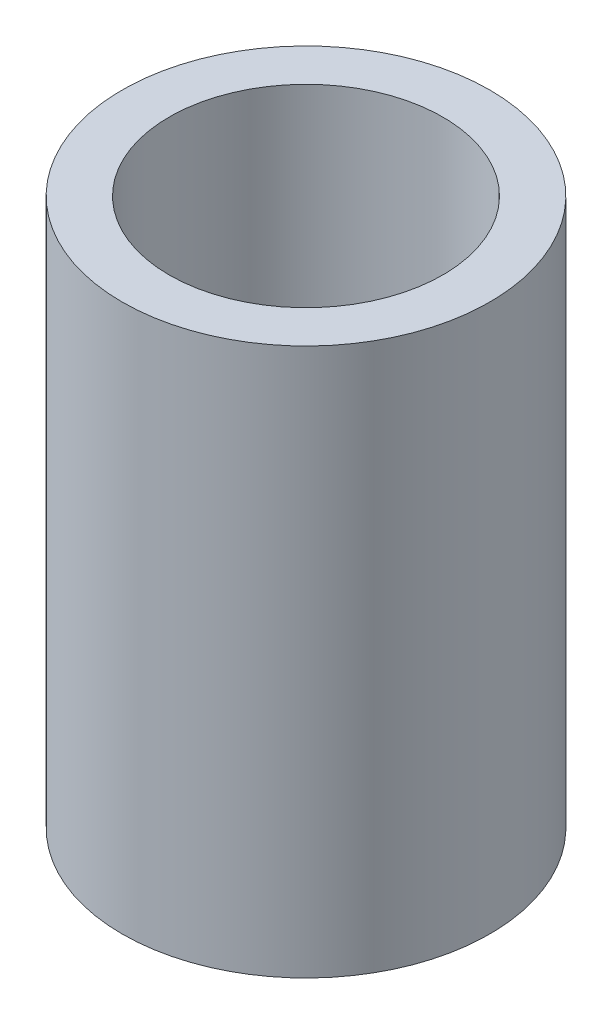
ISO-10303-21;
HEADER;
FILE_DESCRIPTION(('STEP AP214'),'2;1');
FILE_NAME('part.step','',(''),(''),'','','');
FILE_SCHEMA(('AUTOMOTIVE_DESIGN { 1 0 10303 214 1 1 1 1 }'));
ENDSEC;
DATA;
#1=APPLICATION_CONTEXT('core data for automotive mechanical design processes');
#2=APPLICATION_PROTOCOL_DEFINITION('international standard','automotive_design',2000,#1);
#3=PRODUCT_CONTEXT('',#1,'mechanical');
#4=PRODUCT('Part','Part','',(#3));
#5=PRODUCT_RELATED_PRODUCT_CATEGORY('part','',(#4));
#6=PRODUCT_DEFINITION_FORMATION('','',#4);
#7=PRODUCT_DEFINITION_CONTEXT('part definition',#1,'design');
#8=PRODUCT_DEFINITION('design','',#6,#7);
#9=PRODUCT_DEFINITION_SHAPE('','',#8);
#10=(LENGTH_UNIT() NAMED_UNIT(*) SI_UNIT(.MILLI.,.METRE.));
#11=(NAMED_UNIT(*) PLANE_ANGLE_UNIT() SI_UNIT($,.RADIAN.));
#12=(NAMED_UNIT(*) SI_UNIT($,.STERADIAN.) SOLID_ANGLE_UNIT());
#13=UNCERTAINTY_MEASURE_WITH_UNIT(LENGTH_MEASURE(1.E-05),#10,'distance_accuracy_value','');
#14=(GEOMETRIC_REPRESENTATION_CONTEXT(3) GLOBAL_UNCERTAINTY_ASSIGNED_CONTEXT((#13)) GLOBAL_UNIT_ASSIGNED_CONTEXT((#10,
#11,#12)) REPRESENTATION_CONTEXT('',''));
#15=CARTESIAN_POINT('',(0.,0.,0.));
#16=DIRECTION('',(0.,0.,1.));
#17=DIRECTION('',(1.,0.,0.));
#18=AXIS2_PLACEMENT_3D('',#15,#16,#17);
#19=CARTESIAN_POINT('',(0.,14.,0.));
#20=DIRECTION('',(0.,1.,0.));
#21=DIRECTION('',(0.,0.,1.));
#22=AXIS2_PLACEMENT_3D('',#19,#20,#21);
#23=PLANE('',#22);
#24=CARTESIAN_POINT('',(0.,14.,0.));
#25=DIRECTION('',(0.,1.,0.));
#26=DIRECTION('',(0.,0.,1.));
#27=AXIS2_PLACEMENT_3D('',#24,#25,#26);
#28=CIRCLE('',#27,4.7);
#29=CARTESIAN_POINT('',(0.,14.,4.7));
#30=VERTEX_POINT('',#29);
#31=EDGE_CURVE('E10',#30,#30,#28,.T.);
#32=ORIENTED_EDGE('',*,*,#31,.T.);
#33=EDGE_LOOP('',(#32));
#34=FACE_BOUND('',#33,.T.);
#35=CARTESIAN_POINT('',(0.,14.,0.));
#36=DIRECTION('',(0.,1.,0.));
#37=DIRECTION('',(0.,0.,1.));
#38=AXIS2_PLACEMENT_3D('',#35,#36,#37);
#39=CIRCLE('',#38,3.5);
#40=CARTESIAN_POINT('',(0.,14.,3.5));
#41=VERTEX_POINT('',#40);
#42=EDGE_CURVE('E42',#41,#41,#39,.T.);
#43=ORIENTED_EDGE('',*,*,#42,.F.);
#44=EDGE_LOOP('',(#43));
#45=FACE_BOUND('',#44,.T.);
#46=ADVANCED_FACE('F31',(#34,#45),#23,.T.);
#47=CARTESIAN_POINT('',(0.,0.,0.));
#48=DIRECTION('',(0.,1.,0.));
#49=DIRECTION('',(0.,0.,1.));
#50=AXIS2_PLACEMENT_3D('',#47,#48,#49);
#51=PLANE('',#50);
#52=CARTESIAN_POINT('',(0.,0.,0.));
#53=DIRECTION('',(0.,1.,0.));
#54=DIRECTION('',(0.,0.,1.));
#55=AXIS2_PLACEMENT_3D('',#52,#53,#54);
#56=CIRCLE('',#55,4.7);
#57=CARTESIAN_POINT('',(0.,0.,4.7));
#58=VERTEX_POINT('',#57);
#59=EDGE_CURVE('E35',#58,#58,#56,.T.);
#60=ORIENTED_EDGE('',*,*,#59,.F.);
#61=EDGE_LOOP('',(#60));
#62=FACE_BOUND('',#61,.T.);
#63=CARTESIAN_POINT('',(0.,0.,0.));
#64=DIRECTION('',(0.,1.,0.));
#65=DIRECTION('',(0.,0.,1.));
#66=AXIS2_PLACEMENT_3D('',#63,#64,#65);
#67=CIRCLE('',#66,3.5);
#68=CARTESIAN_POINT('',(0.,0.,3.5));
#69=VERTEX_POINT('',#68);
#70=EDGE_CURVE('E44',#69,#69,#67,.T.);
#71=ORIENTED_EDGE('',*,*,#70,.T.);
#72=EDGE_LOOP('',(#71));
#73=FACE_BOUND('',#72,.T.);
#74=ADVANCED_FACE('F54',(#62,#73),#51,.F.);
#75=CARTESIAN_POINT('',(0.,14.,0.));
#76=DIRECTION('',(0.,-1.,0.));
#77=DIRECTION('',(0.,0.,-1.));
#78=AXIS2_PLACEMENT_3D('',#75,#76,#77);
#79=CYLINDRICAL_SURFACE('',#78,4.7);
#80=ORIENTED_EDGE('',*,*,#31,.F.);
#81=EDGE_LOOP('',(#80));
#82=FACE_BOUND('',#81,.T.);
#83=ORIENTED_EDGE('',*,*,#59,.T.);
#84=EDGE_LOOP('',(#83));
#85=FACE_BOUND('',#84,.T.);
#86=ADVANCED_FACE('F33',(#82,#85),#79,.T.);
#87=CARTESIAN_POINT('',(0.,14.,0.));
#88=DIRECTION('',(0.,-1.,0.));
#89=DIRECTION('',(0.,0.,-1.));
#90=AXIS2_PLACEMENT_3D('',#87,#88,#89);
#91=CYLINDRICAL_SURFACE('',#90,3.5);
#92=ORIENTED_EDGE('',*,*,#42,.T.);
#93=EDGE_LOOP('',(#92));
#94=FACE_BOUND('',#93,.T.);
#95=ORIENTED_EDGE('',*,*,#70,.F.);
#96=EDGE_LOOP('',(#95));
#97=FACE_BOUND('',#96,.T.);
#98=ADVANCED_FACE('F50',(#94,#97),#91,.F.);
#99=CLOSED_SHELL('',(#46,#74,#86,#98));
#100=MANIFOLD_SOLID_BREP('B2',#99);
#101=ADVANCED_BREP_SHAPE_REPRESENTATION('',(#18,#100),#14);
#102=SHAPE_DEFINITION_REPRESENTATION(#9,#101);
ENDSEC;
END-ISO-10303-21;
